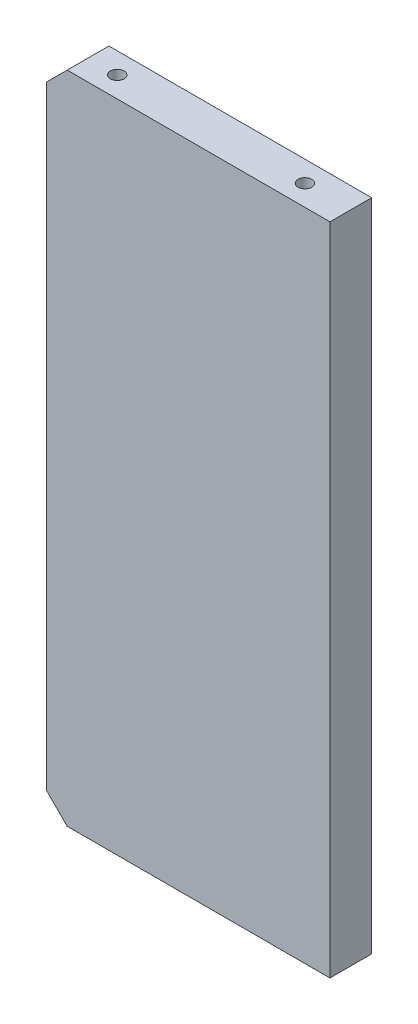
ISO-10303-21;
HEADER;
FILE_DESCRIPTION(('STEP AP214'),'2;1');
FILE_NAME('part.step','',(''),(''),'','','');
FILE_SCHEMA(('AUTOMOTIVE_DESIGN { 1 0 10303 214 1 1 1 1 }'));
ENDSEC;
DATA;
#1=APPLICATION_CONTEXT('core data for automotive mechanical design processes');
#2=APPLICATION_PROTOCOL_DEFINITION('international standard','automotive_design',2000,#1);
#3=PRODUCT_CONTEXT('',#1,'mechanical');
#4=PRODUCT('Part','Part','',(#3));
#5=PRODUCT_RELATED_PRODUCT_CATEGORY('part','',(#4));
#6=PRODUCT_DEFINITION_FORMATION('','',#4);
#7=PRODUCT_DEFINITION_CONTEXT('part definition',#1,'design');
#8=PRODUCT_DEFINITION('design','',#6,#7);
#9=PRODUCT_DEFINITION_SHAPE('','',#8);
#10=(LENGTH_UNIT() NAMED_UNIT(*) SI_UNIT(.MILLI.,.METRE.));
#11=(NAMED_UNIT(*) PLANE_ANGLE_UNIT() SI_UNIT($,.RADIAN.));
#12=(NAMED_UNIT(*) SI_UNIT($,.STERADIAN.) SOLID_ANGLE_UNIT());
#13=UNCERTAINTY_MEASURE_WITH_UNIT(LENGTH_MEASURE(1.E-05),#10,'distance_accuracy_value','');
#14=(GEOMETRIC_REPRESENTATION_CONTEXT(3) GLOBAL_UNCERTAINTY_ASSIGNED_CONTEXT((#13)) GLOBAL_UNIT_ASSIGNED_CONTEXT((#10,
#11,#12)) REPRESENTATION_CONTEXT('',''));
#15=CARTESIAN_POINT('',(0.,0.,0.));
#16=DIRECTION('',(0.,0.,1.));
#17=DIRECTION('',(1.,0.,0.));
#18=AXIS2_PLACEMENT_3D('',#15,#16,#17);
#19=CARTESIAN_POINT('',(68.,-78.5,-10.));
#20=DIRECTION('',(1.,0.,0.));
#21=DIRECTION('',(0.,0.,-1.));
#22=AXIS2_PLACEMENT_3D('',#19,#20,#21);
#23=PLANE('',#22);
#24=DIRECTION('',(0.,1.,0.));
#25=VECTOR('',#24,1.);
#26=CARTESIAN_POINT('',(68.,-78.5,0.));
#27=LINE('',#26,#25);
#28=CARTESIAN_POINT('',(68.,-78.5,0.));
#29=VERTEX_POINT('',#28);
#30=CARTESIAN_POINT('',(68.,78.5,0.));
#31=VERTEX_POINT('',#30);
#32=EDGE_CURVE('E164',#29,#31,#27,.T.);
#33=ORIENTED_EDGE('',*,*,#32,.F.);
#34=DIRECTION('',(0.,0.,1.));
#35=VECTOR('',#34,1.);
#36=CARTESIAN_POINT('',(68.,-78.5,-10.));
#37=LINE('',#36,#35);
#38=CARTESIAN_POINT('',(68.,-78.5,-10.));
#39=VERTEX_POINT('',#38);
#40=EDGE_CURVE('E186',#39,#29,#37,.T.);
#41=ORIENTED_EDGE('',*,*,#40,.F.);
#42=DIRECTION('',(0.,1.,0.));
#43=VECTOR('',#42,1.);
#44=CARTESIAN_POINT('',(68.,-78.5,-10.));
#45=LINE('',#44,#43);
#46=CARTESIAN_POINT('',(68.,78.5,-10.));
#47=VERTEX_POINT('',#46);
#48=EDGE_CURVE('E165',#39,#47,#45,.T.);
#49=ORIENTED_EDGE('',*,*,#48,.T.);
#50=DIRECTION('',(0.,0.,1.));
#51=VECTOR('',#50,1.);
#52=CARTESIAN_POINT('',(68.,78.5,-10.));
#53=LINE('',#52,#51);
#54=EDGE_CURVE('E176',#47,#31,#53,.T.);
#55=ORIENTED_EDGE('',*,*,#54,.T.);
#56=EDGE_LOOP('',(#33,#41,#49,#55));
#57=FACE_BOUND('',#56,.T.);
#58=ADVANCED_FACE('F38',(#57),#23,.T.);
#59=CARTESIAN_POINT('',(68.,-78.5,-10.));
#60=DIRECTION('',(0.,-1.,0.));
#61=DIRECTION('',(1.,0.,0.));
#62=AXIS2_PLACEMENT_3D('',#59,#60,#61);
#63=PLANE('',#62);
#64=CARTESIAN_POINT('',(12.,-78.5,-5.));
#65=DIRECTION('',(0.,-1.,0.));
#66=DIRECTION('',(0.,0.,-1.));
#67=AXIS2_PLACEMENT_3D('',#64,#65,#66);
#68=CIRCLE('',#67,1.65);
#69=CARTESIAN_POINT('',(12.,-78.5,-6.65));
#70=VERTEX_POINT('',#69);
#71=EDGE_CURVE('E124',#70,#70,#68,.T.);
#72=ORIENTED_EDGE('',*,*,#71,.F.);
#73=EDGE_LOOP('',(#72));
#74=FACE_BOUND('',#73,.T.);
#75=CARTESIAN_POINT('',(57.,-78.5,-5.));
#76=DIRECTION('',(0.,-1.,0.));
#77=DIRECTION('',(0.,0.,-1.));
#78=AXIS2_PLACEMENT_3D('',#75,#76,#77);
#79=CIRCLE('',#78,1.65);
#80=CARTESIAN_POINT('',(57.,-78.5,-6.65));
#81=VERTEX_POINT('',#80);
#82=EDGE_CURVE('E123',#81,#81,#79,.T.);
#83=ORIENTED_EDGE('',*,*,#82,.F.);
#84=EDGE_LOOP('',(#83));
#85=FACE_BOUND('',#84,.T.);
#86=DIRECTION('',(1.,0.,0.));
#87=VECTOR('',#86,1.);
#88=CARTESIAN_POINT('',(68.,-78.5,0.));
#89=LINE('',#88,#87);
#90=CARTESIAN_POINT('',(5.00000000000002,-78.5,0.));
#91=VERTEX_POINT('',#90);
#92=EDGE_CURVE('E169',#91,#29,#89,.T.);
#93=ORIENTED_EDGE('',*,*,#92,.F.);
#94=DIRECTION('',(0.,0.,-1.));
#95=VECTOR('',#94,1.);
#96=CARTESIAN_POINT('',(5.00000000000002,-78.5,-10.));
#97=LINE('',#96,#95);
#98=CARTESIAN_POINT('',(5.00000000000003,-78.5,-10.));
#99=VERTEX_POINT('',#98);
#100=EDGE_CURVE('E61',#91,#99,#97,.T.);
#101=ORIENTED_EDGE('',*,*,#100,.T.);
#102=DIRECTION('',(1.,0.,0.));
#103=VECTOR('',#102,1.);
#104=CARTESIAN_POINT('',(68.,-78.5,-10.));
#105=LINE('',#104,#103);
#106=EDGE_CURVE('E174',#99,#39,#105,.T.);
#107=ORIENTED_EDGE('',*,*,#106,.T.);
#108=ORIENTED_EDGE('',*,*,#40,.T.);
#109=EDGE_LOOP('',(#93,#101,#107,#108));
#110=FACE_BOUND('',#109,.T.);
#111=ADVANCED_FACE('F212',(#74,#85,#110),#63,.T.);
#112=CARTESIAN_POINT('',(0.,-78.5,-10.));
#113=DIRECTION('',(-1.,0.,0.));
#114=DIRECTION('',(0.,0.,1.));
#115=AXIS2_PLACEMENT_3D('',#112,#113,#114);
#116=PLANE('',#115);
#117=CARTESIAN_POINT('',(0.,58.5,-5.));
#118=DIRECTION('',(-1.,0.,0.));
#119=DIRECTION('',(0.,0.,1.));
#120=AXIS2_PLACEMENT_3D('',#117,#118,#119);
#121=CIRCLE('',#120,2.1);
#122=CARTESIAN_POINT('',(0.,58.5,-2.9));
#123=VERTEX_POINT('',#122);
#124=EDGE_CURVE('E146',#123,#123,#121,.T.);
#125=ORIENTED_EDGE('',*,*,#124,.F.);
#126=EDGE_LOOP('',(#125));
#127=FACE_BOUND('',#126,.T.);
#128=CARTESIAN_POINT('',(0.,0.,-5.));
#129=DIRECTION('',(-1.,0.,0.));
#130=DIRECTION('',(0.,0.,1.));
#131=AXIS2_PLACEMENT_3D('',#128,#129,#130);
#132=CIRCLE('',#131,2.1);
#133=CARTESIAN_POINT('',(0.,0.,-2.9));
#134=VERTEX_POINT('',#133);
#135=EDGE_CURVE('E152',#134,#134,#132,.T.);
#136=ORIENTED_EDGE('',*,*,#135,.F.);
#137=EDGE_LOOP('',(#136));
#138=FACE_BOUND('',#137,.T.);
#139=CARTESIAN_POINT('',(0.,-58.5,-5.));
#140=DIRECTION('',(-1.,0.,0.));
#141=DIRECTION('',(0.,0.,1.));
#142=AXIS2_PLACEMENT_3D('',#139,#140,#141);
#143=CIRCLE('',#142,2.1);
#144=CARTESIAN_POINT('',(0.,-58.5,-2.9));
#145=VERTEX_POINT('',#144);
#146=EDGE_CURVE('E158',#145,#145,#143,.T.);
#147=ORIENTED_EDGE('',*,*,#146,.F.);
#148=EDGE_LOOP('',(#147));
#149=FACE_BOUND('',#148,.T.);
#150=DIRECTION('',(0.,-1.,0.));
#151=VECTOR('',#150,1.);
#152=CARTESIAN_POINT('',(0.,-78.5,-10.));
#153=LINE('',#152,#151);
#154=CARTESIAN_POINT('',(0.,73.5,-10.));
#155=VERTEX_POINT('',#154);
#156=CARTESIAN_POINT('',(0.,-73.5,-10.));
#157=VERTEX_POINT('',#156);
#158=EDGE_CURVE('E171',#155,#157,#153,.T.);
#159=ORIENTED_EDGE('',*,*,#158,.T.);
#160=DIRECTION('',(0.,0.,1.));
#161=VECTOR('',#160,1.);
#162=CARTESIAN_POINT('',(0.,-73.5,-10.));
#163=LINE('',#162,#161);
#164=CARTESIAN_POINT('',(0.,-73.5,0.));
#165=VERTEX_POINT('',#164);
#166=EDGE_CURVE('E192',#157,#165,#163,.T.);
#167=ORIENTED_EDGE('',*,*,#166,.T.);
#168=DIRECTION('',(0.,-1.,0.));
#169=VECTOR('',#168,1.);
#170=CARTESIAN_POINT('',(0.,-78.5,0.));
#171=LINE('',#170,#169);
#172=CARTESIAN_POINT('',(0.,73.5,0.));
#173=VERTEX_POINT('',#172);
#174=EDGE_CURVE('E182',#173,#165,#171,.T.);
#175=ORIENTED_EDGE('',*,*,#174,.F.);
#176=DIRECTION('',(0.,0.,-1.));
#177=VECTOR('',#176,1.);
#178=CARTESIAN_POINT('',(0.,73.5,-10.));
#179=LINE('',#178,#177);
#180=EDGE_CURVE('E189',#173,#155,#179,.T.);
#181=ORIENTED_EDGE('',*,*,#180,.T.);
#182=EDGE_LOOP('',(#159,#167,#175,#181));
#183=FACE_BOUND('',#182,.T.);
#184=ADVANCED_FACE('F206',(#127,#138,#149,#183),#116,.T.);
#185=CARTESIAN_POINT('',(68.,78.5,-10.));
#186=DIRECTION('',(0.,1.,0.));
#187=DIRECTION('',(-1.,0.,0.));
#188=AXIS2_PLACEMENT_3D('',#185,#186,#187);
#189=PLANE('',#188);
#190=CARTESIAN_POINT('',(12.,78.5,-5.));
#191=DIRECTION('',(0.,1.,0.));
#192=DIRECTION('',(0.,0.,1.));
#193=AXIS2_PLACEMENT_3D('',#190,#191,#192);
#194=CIRCLE('',#193,1.65);
#195=CARTESIAN_POINT('',(12.,78.5,-3.35));
#196=VERTEX_POINT('',#195);
#197=EDGE_CURVE('E134',#196,#196,#194,.T.);
#198=ORIENTED_EDGE('',*,*,#197,.F.);
#199=EDGE_LOOP('',(#198));
#200=FACE_BOUND('',#199,.T.);
#201=CARTESIAN_POINT('',(57.,78.5,-5.));
#202=DIRECTION('',(0.,1.,0.));
#203=DIRECTION('',(0.,0.,1.));
#204=AXIS2_PLACEMENT_3D('',#201,#202,#203);
#205=CIRCLE('',#204,1.65);
#206=CARTESIAN_POINT('',(57.,78.5,-3.35));
#207=VERTEX_POINT('',#206);
#208=EDGE_CURVE('E140',#207,#207,#205,.T.);
#209=ORIENTED_EDGE('',*,*,#208,.F.);
#210=EDGE_LOOP('',(#209));
#211=FACE_BOUND('',#210,.T.);
#212=DIRECTION('',(-1.,0.,0.));
#213=VECTOR('',#212,1.);
#214=CARTESIAN_POINT('',(68.,78.5,-10.));
#215=LINE('',#214,#213);
#216=CARTESIAN_POINT('',(4.99999999999999,78.5,-10.));
#217=VERTEX_POINT('',#216);
#218=EDGE_CURVE('E168',#47,#217,#215,.T.);
#219=ORIENTED_EDGE('',*,*,#218,.T.);
#220=DIRECTION('',(0.,0.,1.));
#221=VECTOR('',#220,1.);
#222=CARTESIAN_POINT('',(5.,78.5,-10.));
#223=LINE('',#222,#221);
#224=CARTESIAN_POINT('',(5.,78.5,0.));
#225=VERTEX_POINT('',#224);
#226=EDGE_CURVE('E11',#217,#225,#223,.T.);
#227=ORIENTED_EDGE('',*,*,#226,.T.);
#228=DIRECTION('',(-1.,0.,0.));
#229=VECTOR('',#228,1.);
#230=CARTESIAN_POINT('',(68.,78.5,0.));
#231=LINE('',#230,#229);
#232=EDGE_CURVE('E179',#31,#225,#231,.T.);
#233=ORIENTED_EDGE('',*,*,#232,.F.);
#234=ORIENTED_EDGE('',*,*,#54,.F.);
#235=EDGE_LOOP('',(#219,#227,#233,#234));
#236=FACE_BOUND('',#235,.T.);
#237=ADVANCED_FACE('F218',(#200,#211,#236),#189,.T.);
#238=CARTESIAN_POINT('',(68.,78.5,-10.));
#239=DIRECTION('',(0.,0.,1.));
#240=DIRECTION('',(1.,0.,0.));
#241=AXIS2_PLACEMENT_3D('',#238,#239,#240);
#242=PLANE('',#241);
#243=ORIENTED_EDGE('',*,*,#106,.F.);
#244=DIRECTION('',(0.707106781186549,-0.707106781186547,0.));
#245=VECTOR('',#244,1.);
#246=CARTESIAN_POINT('',(0.,-73.5,-10.));
#247=LINE('',#246,#245);
#248=EDGE_CURVE('E46',#99,#157,#247,.F.);
#249=ORIENTED_EDGE('',*,*,#248,.T.);
#250=ORIENTED_EDGE('',*,*,#158,.F.);
#251=DIRECTION('',(-0.707106781186546,-0.707106781186549,0.));
#252=VECTOR('',#251,1.);
#253=CARTESIAN_POINT('',(5.,78.5,-10.));
#254=LINE('',#253,#252);
#255=EDGE_CURVE('E53',#155,#217,#254,.F.);
#256=ORIENTED_EDGE('',*,*,#255,.T.);
#257=ORIENTED_EDGE('',*,*,#218,.F.);
#258=ORIENTED_EDGE('',*,*,#48,.F.);
#259=EDGE_LOOP('',(#243,#249,#250,#256,#257,#258));
#260=FACE_BOUND('',#259,.T.);
#261=ADVANCED_FACE('F201',(#260),#242,.F.);
#262=CARTESIAN_POINT('',(68.,78.5,0.));
#263=DIRECTION('',(0.,0.,1.));
#264=DIRECTION('',(1.,0.,0.));
#265=AXIS2_PLACEMENT_3D('',#262,#263,#264);
#266=PLANE('',#265);
#267=ORIENTED_EDGE('',*,*,#174,.T.);
#268=DIRECTION('',(-0.707106781186549,0.707106781186547,0.));
#269=VECTOR('',#268,1.);
#270=CARTESIAN_POINT('',(-41.9999999999999,-31.5000000000002,0.));
#271=LINE('',#270,#269);
#272=EDGE_CURVE('E197',#165,#91,#271,.F.);
#273=ORIENTED_EDGE('',*,*,#272,.T.);
#274=ORIENTED_EDGE('',*,*,#92,.T.);
#275=ORIENTED_EDGE('',*,*,#32,.T.);
#276=ORIENTED_EDGE('',*,*,#232,.T.);
#277=DIRECTION('',(0.707106781186546,0.707106781186549,0.));
#278=VECTOR('',#277,1.);
#279=CARTESIAN_POINT('',(36.4999999999998,110.,0.));
#280=LINE('',#279,#278);
#281=EDGE_CURVE('E195',#225,#173,#280,.F.);
#282=ORIENTED_EDGE('',*,*,#281,.T.);
#283=EDGE_LOOP('',(#267,#273,#274,#275,#276,#282));
#284=FACE_BOUND('',#283,.T.);
#285=ADVANCED_FACE('F211',(#284),#266,.T.);
#286=CARTESIAN_POINT('',(12.4,-58.5,-5.));
#287=DIRECTION('',(-1.,0.,0.));
#288=DIRECTION('',(0.,0.,1.));
#289=AXIS2_PLACEMENT_3D('',#286,#287,#288);
#290=CONICAL_SURFACE('',#289,2.1,1.02974425867665);
#291=CARTESIAN_POINT('',(13.6618072999579,-58.5,-5.));
#292=VERTEX_POINT('',#291);
#293=VERTEX_LOOP('',#292);
#294=FACE_BOUND('',#293,.T.);
#295=CARTESIAN_POINT('',(12.4,-58.5,-5.));
#296=DIRECTION('',(-1.,0.,0.));
#297=DIRECTION('',(0.,0.,1.));
#298=AXIS2_PLACEMENT_3D('',#295,#296,#297);
#299=CIRCLE('',#298,2.1);
#300=CARTESIAN_POINT('',(12.4,-58.5,-2.9));
#301=VERTEX_POINT('',#300);
#302=EDGE_CURVE('E161',#301,#301,#299,.T.);
#303=ORIENTED_EDGE('',*,*,#302,.T.);
#304=EDGE_LOOP('',(#303));
#305=FACE_BOUND('',#304,.T.);
#306=ADVANCED_FACE('F241',(#294,#305),#290,.F.);
#307=CARTESIAN_POINT('',(0.,-58.5,-5.));
#308=DIRECTION('',(-1.,0.,0.));
#309=DIRECTION('',(0.,0.,1.));
#310=AXIS2_PLACEMENT_3D('',#307,#308,#309);
#311=CYLINDRICAL_SURFACE('',#310,2.1);
#312=ORIENTED_EDGE('',*,*,#302,.F.);
#313=EDGE_LOOP('',(#312));
#314=FACE_BOUND('',#313,.T.);
#315=ORIENTED_EDGE('',*,*,#146,.T.);
#316=EDGE_LOOP('',(#315));
#317=FACE_BOUND('',#316,.T.);
#318=ADVANCED_FACE('F246',(#314,#317),#311,.F.);
#319=CARTESIAN_POINT('',(12.4,0.,-5.));
#320=DIRECTION('',(-1.,0.,0.));
#321=DIRECTION('',(0.,0.,1.));
#322=AXIS2_PLACEMENT_3D('',#319,#320,#321);
#323=CONICAL_SURFACE('',#322,2.1,1.02974425867665);
#324=CARTESIAN_POINT('',(13.6618072999579,0.,-5.));
#325=VERTEX_POINT('',#324);
#326=VERTEX_LOOP('',#325);
#327=FACE_BOUND('',#326,.T.);
#328=CARTESIAN_POINT('',(12.4,0.,-5.));
#329=DIRECTION('',(-1.,0.,0.));
#330=DIRECTION('',(0.,0.,1.));
#331=AXIS2_PLACEMENT_3D('',#328,#329,#330);
#332=CIRCLE('',#331,2.1);
#333=CARTESIAN_POINT('',(12.4,0.,-2.9));
#334=VERTEX_POINT('',#333);
#335=EDGE_CURVE('E155',#334,#334,#332,.T.);
#336=ORIENTED_EDGE('',*,*,#335,.T.);
#337=EDGE_LOOP('',(#336));
#338=FACE_BOUND('',#337,.T.);
#339=ADVANCED_FACE('F250',(#327,#338),#323,.F.);
#340=CARTESIAN_POINT('',(0.,0.,-5.));
#341=DIRECTION('',(-1.,0.,0.));
#342=DIRECTION('',(0.,0.,1.));
#343=AXIS2_PLACEMENT_3D('',#340,#341,#342);
#344=CYLINDRICAL_SURFACE('',#343,2.1);
#345=ORIENTED_EDGE('',*,*,#335,.F.);
#346=EDGE_LOOP('',(#345));
#347=FACE_BOUND('',#346,.T.);
#348=ORIENTED_EDGE('',*,*,#135,.T.);
#349=EDGE_LOOP('',(#348));
#350=FACE_BOUND('',#349,.T.);
#351=ADVANCED_FACE('F254',(#347,#350),#344,.F.);
#352=CARTESIAN_POINT('',(12.4,58.5,-5.));
#353=DIRECTION('',(-1.,0.,0.));
#354=DIRECTION('',(0.,0.,1.));
#355=AXIS2_PLACEMENT_3D('',#352,#353,#354);
#356=CONICAL_SURFACE('',#355,2.1,1.02974425867665);
#357=CARTESIAN_POINT('',(13.6618072999579,58.5,-5.));
#358=VERTEX_POINT('',#357);
#359=VERTEX_LOOP('',#358);
#360=FACE_BOUND('',#359,.T.);
#361=CARTESIAN_POINT('',(12.4,58.5,-5.));
#362=DIRECTION('',(-1.,0.,0.));
#363=DIRECTION('',(0.,0.,1.));
#364=AXIS2_PLACEMENT_3D('',#361,#362,#363);
#365=CIRCLE('',#364,2.1);
#366=CARTESIAN_POINT('',(12.4,58.5,-2.9));
#367=VERTEX_POINT('',#366);
#368=EDGE_CURVE('E149',#367,#367,#365,.T.);
#369=ORIENTED_EDGE('',*,*,#368,.T.);
#370=EDGE_LOOP('',(#369));
#371=FACE_BOUND('',#370,.T.);
#372=ADVANCED_FACE('F258',(#360,#371),#356,.F.);
#373=CARTESIAN_POINT('',(0.,58.5,-5.));
#374=DIRECTION('',(-1.,0.,0.));
#375=DIRECTION('',(0.,0.,1.));
#376=AXIS2_PLACEMENT_3D('',#373,#374,#375);
#377=CYLINDRICAL_SURFACE('',#376,2.1);
#378=ORIENTED_EDGE('',*,*,#368,.F.);
#379=EDGE_LOOP('',(#378));
#380=FACE_BOUND('',#379,.T.);
#381=ORIENTED_EDGE('',*,*,#124,.T.);
#382=EDGE_LOOP('',(#381));
#383=FACE_BOUND('',#382,.T.);
#384=ADVANCED_FACE('F262',(#380,#383),#377,.F.);
#385=CARTESIAN_POINT('',(57.,62.4,-5.));
#386=DIRECTION('',(0.,1.,0.));
#387=DIRECTION('',(0.,0.,1.));
#388=AXIS2_PLACEMENT_3D('',#385,#386,#387);
#389=CONICAL_SURFACE('',#388,1.65,1.02974425867665);
#390=CARTESIAN_POINT('',(57.,61.4085799786045,-5.));
#391=VERTEX_POINT('',#390);
#392=VERTEX_LOOP('',#391);
#393=FACE_BOUND('',#392,.T.);
#394=CARTESIAN_POINT('',(57.,62.4,-5.));
#395=DIRECTION('',(0.,1.,0.));
#396=DIRECTION('',(0.,0.,1.));
#397=AXIS2_PLACEMENT_3D('',#394,#395,#396);
#398=CIRCLE('',#397,1.65);
#399=CARTESIAN_POINT('',(57.,62.4,-3.35));
#400=VERTEX_POINT('',#399);
#401=EDGE_CURVE('E143',#400,#400,#398,.T.);
#402=ORIENTED_EDGE('',*,*,#401,.T.);
#403=EDGE_LOOP('',(#402));
#404=FACE_BOUND('',#403,.T.);
#405=ADVANCED_FACE('F266',(#393,#404),#389,.F.);
#406=CARTESIAN_POINT('',(57.,78.5,-5.));
#407=DIRECTION('',(0.,1.,0.));
#408=DIRECTION('',(0.,0.,1.));
#409=AXIS2_PLACEMENT_3D('',#406,#407,#408);
#410=CYLINDRICAL_SURFACE('',#409,1.65);
#411=ORIENTED_EDGE('',*,*,#401,.F.);
#412=EDGE_LOOP('',(#411));
#413=FACE_BOUND('',#412,.T.);
#414=ORIENTED_EDGE('',*,*,#208,.T.);
#415=EDGE_LOOP('',(#414));
#416=FACE_BOUND('',#415,.T.);
#417=ADVANCED_FACE('F270',(#413,#416),#410,.F.);
#418=CARTESIAN_POINT('',(12.,62.4,-5.));
#419=DIRECTION('',(0.,1.,0.));
#420=DIRECTION('',(0.,0.,1.));
#421=AXIS2_PLACEMENT_3D('',#418,#419,#420);
#422=CONICAL_SURFACE('',#421,1.65,1.02974425867665);
#423=CARTESIAN_POINT('',(12.,61.4085799786045,-5.));
#424=VERTEX_POINT('',#423);
#425=VERTEX_LOOP('',#424);
#426=FACE_BOUND('',#425,.T.);
#427=CARTESIAN_POINT('',(12.,62.4,-5.));
#428=DIRECTION('',(0.,1.,0.));
#429=DIRECTION('',(0.,0.,1.));
#430=AXIS2_PLACEMENT_3D('',#427,#428,#429);
#431=CIRCLE('',#430,1.65);
#432=CARTESIAN_POINT('',(12.,62.4,-3.35));
#433=VERTEX_POINT('',#432);
#434=EDGE_CURVE('E137',#433,#433,#431,.T.);
#435=ORIENTED_EDGE('',*,*,#434,.T.);
#436=EDGE_LOOP('',(#435));
#437=FACE_BOUND('',#436,.T.);
#438=ADVANCED_FACE('F274',(#426,#437),#422,.F.);
#439=CARTESIAN_POINT('',(12.,78.5,-5.));
#440=DIRECTION('',(0.,1.,0.));
#441=DIRECTION('',(0.,0.,1.));
#442=AXIS2_PLACEMENT_3D('',#439,#440,#441);
#443=CYLINDRICAL_SURFACE('',#442,1.65);
#444=ORIENTED_EDGE('',*,*,#434,.F.);
#445=EDGE_LOOP('',(#444));
#446=FACE_BOUND('',#445,.T.);
#447=ORIENTED_EDGE('',*,*,#197,.T.);
#448=EDGE_LOOP('',(#447));
#449=FACE_BOUND('',#448,.T.);
#450=ADVANCED_FACE('F278',(#446,#449),#443,.F.);
#451=CARTESIAN_POINT('',(57.,-62.4,-5.));
#452=DIRECTION('',(0.,-1.,0.));
#453=DIRECTION('',(0.,0.,-1.));
#454=AXIS2_PLACEMENT_3D('',#451,#452,#453);
#455=CONICAL_SURFACE('',#454,1.65,1.02974425867665);
#456=CARTESIAN_POINT('',(57.,-61.4085799786045,-5.));
#457=VERTEX_POINT('',#456);
#458=VERTEX_LOOP('',#457);
#459=FACE_BOUND('',#458,.T.);
#460=CARTESIAN_POINT('',(57.,-62.4,-5.));
#461=DIRECTION('',(0.,-1.,0.));
#462=DIRECTION('',(0.,0.,-1.));
#463=AXIS2_PLACEMENT_3D('',#460,#461,#462);
#464=CIRCLE('',#463,1.65);
#465=CARTESIAN_POINT('',(57.,-62.4,-6.65));
#466=VERTEX_POINT('',#465);
#467=EDGE_CURVE('E127',#466,#466,#464,.T.);
#468=ORIENTED_EDGE('',*,*,#467,.T.);
#469=EDGE_LOOP('',(#468));
#470=FACE_BOUND('',#469,.T.);
#471=ADVANCED_FACE('F282',(#459,#470),#455,.F.);
#472=CARTESIAN_POINT('',(57.,-78.5,-5.));
#473=DIRECTION('',(0.,-1.,0.));
#474=DIRECTION('',(0.,0.,-1.));
#475=AXIS2_PLACEMENT_3D('',#472,#473,#474);
#476=CYLINDRICAL_SURFACE('',#475,1.65);
#477=ORIENTED_EDGE('',*,*,#467,.F.);
#478=EDGE_LOOP('',(#477));
#479=FACE_BOUND('',#478,.T.);
#480=ORIENTED_EDGE('',*,*,#82,.T.);
#481=EDGE_LOOP('',(#480));
#482=FACE_BOUND('',#481,.T.);
#483=ADVANCED_FACE('F117',(#479,#482),#476,.F.);
#484=CARTESIAN_POINT('',(12.,-62.4,-5.));
#485=DIRECTION('',(0.,-1.,0.));
#486=DIRECTION('',(0.,0.,-1.));
#487=AXIS2_PLACEMENT_3D('',#484,#485,#486);
#488=CONICAL_SURFACE('',#487,1.65,1.02974425867665);
#489=CARTESIAN_POINT('',(12.,-61.4085799786045,-5.));
#490=VERTEX_POINT('',#489);
#491=VERTEX_LOOP('',#490);
#492=FACE_BOUND('',#491,.T.);
#493=CARTESIAN_POINT('',(12.,-62.4,-5.));
#494=DIRECTION('',(0.,-1.,0.));
#495=DIRECTION('',(0.,0.,-1.));
#496=AXIS2_PLACEMENT_3D('',#493,#494,#495);
#497=CIRCLE('',#496,1.65);
#498=CARTESIAN_POINT('',(12.,-62.4,-6.65));
#499=VERTEX_POINT('',#498);
#500=EDGE_CURVE('E121',#499,#499,#497,.T.);
#501=ORIENTED_EDGE('',*,*,#500,.T.);
#502=EDGE_LOOP('',(#501));
#503=FACE_BOUND('',#502,.T.);
#504=ADVANCED_FACE('F113',(#492,#503),#488,.F.);
#505=CARTESIAN_POINT('',(12.,-78.5,-5.));
#506=DIRECTION('',(0.,-1.,0.));
#507=DIRECTION('',(0.,0.,-1.));
#508=AXIS2_PLACEMENT_3D('',#505,#506,#507);
#509=CYLINDRICAL_SURFACE('',#508,1.65);
#510=ORIENTED_EDGE('',*,*,#500,.F.);
#511=EDGE_LOOP('',(#510));
#512=FACE_BOUND('',#511,.T.);
#513=ORIENTED_EDGE('',*,*,#71,.T.);
#514=EDGE_LOOP('',(#513));
#515=FACE_BOUND('',#514,.T.);
#516=ADVANCED_FACE('F116',(#512,#515),#509,.F.);
#517=CARTESIAN_POINT('',(0.,-73.5,-10.));
#518=DIRECTION('',(0.707106781186547,0.707106781186549,0.));
#519=DIRECTION('',(-0.707106781186549,0.707106781186547,0.));
#520=AXIS2_PLACEMENT_3D('',#517,#518,#519);
#521=PLANE('',#520);
#522=ORIENTED_EDGE('',*,*,#248,.F.);
#523=ORIENTED_EDGE('',*,*,#100,.F.);
#524=ORIENTED_EDGE('',*,*,#272,.F.);
#525=ORIENTED_EDGE('',*,*,#166,.F.);
#526=EDGE_LOOP('',(#522,#523,#524,#525));
#527=FACE_BOUND('',#526,.T.);
#528=ADVANCED_FACE('F209',(#527),#521,.F.);
#529=CARTESIAN_POINT('',(5.,78.5,-10.));
#530=DIRECTION('',(0.707106781186549,-0.707106781186545,0.));
#531=DIRECTION('',(0.707106781186546,0.707106781186549,0.));
#532=AXIS2_PLACEMENT_3D('',#529,#530,#531);
#533=PLANE('',#532);
#534=ORIENTED_EDGE('',*,*,#255,.F.);
#535=ORIENTED_EDGE('',*,*,#180,.F.);
#536=ORIENTED_EDGE('',*,*,#281,.F.);
#537=ORIENTED_EDGE('',*,*,#226,.F.);
#538=EDGE_LOOP('',(#534,#535,#536,#537));
#539=FACE_BOUND('',#538,.T.);
#540=ADVANCED_FACE('F40',(#539),#533,.F.);
#541=CLOSED_SHELL('',(#58,#111,#184,#237,#261,#285,#306,#318,#339,#351,#372,#384,#405,#417,#438,
#450,#471,#483,#504,#516,#528,#540));
#542=MANIFOLD_SOLID_BREP('B2',#541);
#543=ADVANCED_BREP_SHAPE_REPRESENTATION('',(#18,#542),#14);
#544=SHAPE_DEFINITION_REPRESENTATION(#9,#543);
ENDSEC;
END-ISO-10303-21;
